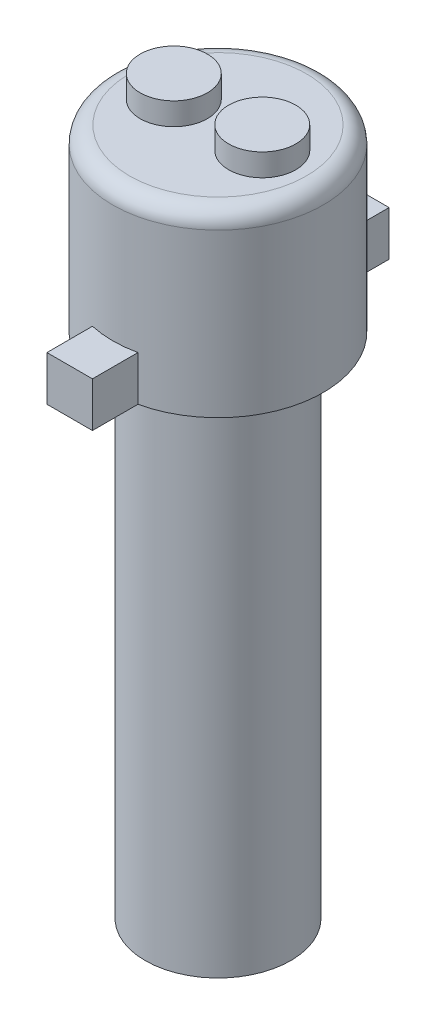
ISO-10303-21;
HEADER;
FILE_DESCRIPTION(('STEP AP214'),'2;1');
FILE_NAME('part.step','',(''),(''),'','','');
FILE_SCHEMA(('AUTOMOTIVE_DESIGN { 1 0 10303 214 1 1 1 1 }'));
ENDSEC;
DATA;
#1=APPLICATION_CONTEXT('core data for automotive mechanical design processes');
#2=APPLICATION_PROTOCOL_DEFINITION('international standard','automotive_design',2000,#1);
#3=PRODUCT_CONTEXT('',#1,'mechanical');
#4=PRODUCT('Part','Part','',(#3));
#5=PRODUCT_RELATED_PRODUCT_CATEGORY('part','',(#4));
#6=PRODUCT_DEFINITION_FORMATION('','',#4);
#7=PRODUCT_DEFINITION_CONTEXT('part definition',#1,'design');
#8=PRODUCT_DEFINITION('design','',#6,#7);
#9=PRODUCT_DEFINITION_SHAPE('','',#8);
#10=(LENGTH_UNIT() NAMED_UNIT(*) SI_UNIT(.MILLI.,.METRE.));
#11=(NAMED_UNIT(*) PLANE_ANGLE_UNIT() SI_UNIT($,.RADIAN.));
#12=(NAMED_UNIT(*) SI_UNIT($,.STERADIAN.) SOLID_ANGLE_UNIT());
#13=UNCERTAINTY_MEASURE_WITH_UNIT(LENGTH_MEASURE(1.E-05),#10,'distance_accuracy_value','');
#14=(GEOMETRIC_REPRESENTATION_CONTEXT(3) GLOBAL_UNCERTAINTY_ASSIGNED_CONTEXT((#13)) GLOBAL_UNIT_ASSIGNED_CONTEXT((#10,
#11,#12)) REPRESENTATION_CONTEXT('',''));
#15=CARTESIAN_POINT('',(0.,0.,0.));
#16=DIRECTION('',(0.,0.,1.));
#17=DIRECTION('',(1.,0.,0.));
#18=AXIS2_PLACEMENT_3D('',#15,#16,#17);
#19=CARTESIAN_POINT('',(0.,22.686,0.));
#20=DIRECTION('',(0.,-1.,0.));
#21=DIRECTION('',(0.,0.,-1.));
#22=AXIS2_PLACEMENT_3D('',#19,#20,#21);
#23=CYLINDRICAL_SURFACE('',#22,3.25);
#24=CARTESIAN_POINT('',(0.,22.686,0.));
#25=DIRECTION('',(0.,1.,0.));
#26=DIRECTION('',(0.,0.,1.));
#27=AXIS2_PLACEMENT_3D('',#24,#25,#26);
#28=CIRCLE('',#27,3.25);
#29=CARTESIAN_POINT('',(0.,22.686,3.25));
#30=VERTEX_POINT('',#29);
#31=EDGE_CURVE('E238',#30,#30,#28,.T.);
#32=ORIENTED_EDGE('',*,*,#31,.F.);
#33=EDGE_LOOP('',(#32));
#34=FACE_BOUND('',#33,.T.);
#35=CARTESIAN_POINT('',(0.,0.,0.));
#36=DIRECTION('',(0.,1.,0.));
#37=DIRECTION('',(0.,0.,1.));
#38=AXIS2_PLACEMENT_3D('',#35,#36,#37);
#39=CIRCLE('',#38,3.25);
#40=CARTESIAN_POINT('',(0.,0.,3.25));
#41=VERTEX_POINT('',#40);
#42=EDGE_CURVE('E237',#41,#41,#39,.T.);
#43=ORIENTED_EDGE('',*,*,#42,.T.);
#44=EDGE_LOOP('',(#43));
#45=FACE_BOUND('',#44,.T.);
#46=ADVANCED_FACE('F65',(#34,#45),#23,.T.);
#47=CARTESIAN_POINT('',(0.,0.,0.));
#48=DIRECTION('',(0.,1.,0.));
#49=DIRECTION('',(0.,0.,1.));
#50=AXIS2_PLACEMENT_3D('',#47,#48,#49);
#51=PLANE('',#50);
#52=ORIENTED_EDGE('',*,*,#42,.F.);
#53=EDGE_LOOP('',(#52));
#54=FACE_BOUND('',#53,.T.);
#55=ADVANCED_FACE('F267',(#54),#51,.F.);
#56=CARTESIAN_POINT('',(0.,30.686,0.));
#57=DIRECTION('',(0.,-1.,0.));
#58=DIRECTION('',(0.,0.,-1.));
#59=AXIS2_PLACEMENT_3D('',#56,#57,#58);
#60=CYLINDRICAL_SURFACE('',#59,4.7);
#61=CARTESIAN_POINT('',(0.,22.686,0.));
#62=DIRECTION('',(0.,1.,0.));
#63=DIRECTION('',(0.,0.,1.));
#64=AXIS2_PLACEMENT_3D('',#61,#62,#63);
#65=CIRCLE('',#64,4.7);
#66=CARTESIAN_POINT('',(-1.016,22.686,-4.58887175676113));
#67=VERTEX_POINT('',#66);
#68=CARTESIAN_POINT('',(-1.016,22.686,4.58887175676113));
#69=VERTEX_POINT('',#68);
#70=EDGE_CURVE('E230',#67,#69,#65,.T.);
#71=ORIENTED_EDGE('',*,*,#70,.T.);
#72=DIRECTION('',(0.,-1.,0.));
#73=VECTOR('',#72,1.);
#74=CARTESIAN_POINT('',(-1.016,24.686,4.58887175676113));
#75=LINE('',#74,#73);
#76=CARTESIAN_POINT('',(-1.016,24.686,4.58887175676113));
#77=VERTEX_POINT('',#76);
#78=EDGE_CURVE('E81',#77,#69,#75,.T.);
#79=ORIENTED_EDGE('',*,*,#78,.F.);
#80=CARTESIAN_POINT('',(0.,24.686,0.));
#81=DIRECTION('',(0.,1.,0.));
#82=DIRECTION('',(0.,0.,-1.));
#83=AXIS2_PLACEMENT_3D('',#80,#81,#82);
#84=CIRCLE('',#83,4.7);
#85=CARTESIAN_POINT('',(1.016,24.686,4.58887175676113));
#86=VERTEX_POINT('',#85);
#87=EDGE_CURVE('E85',#77,#86,#84,.T.);
#88=ORIENTED_EDGE('',*,*,#87,.T.);
#89=DIRECTION('',(0.,-1.,0.));
#90=VECTOR('',#89,1.);
#91=CARTESIAN_POINT('',(1.016,24.686,4.58887175676113));
#92=LINE('',#91,#90);
#93=CARTESIAN_POINT('',(1.016,22.686,4.58887175676113));
#94=VERTEX_POINT('',#93);
#95=EDGE_CURVE('E143',#86,#94,#92,.T.);
#96=ORIENTED_EDGE('',*,*,#95,.T.);
#97=CARTESIAN_POINT('',(1.016,22.686,-4.58887175676113));
#98=VERTEX_POINT('',#97);
#99=EDGE_CURVE('E234',#94,#98,#65,.T.);
#100=ORIENTED_EDGE('',*,*,#99,.T.);
#101=DIRECTION('',(0.,-1.,0.));
#102=VECTOR('',#101,1.);
#103=CARTESIAN_POINT('',(1.016,24.686,-4.58887175676113));
#104=LINE('',#103,#102);
#105=CARTESIAN_POINT('',(1.016,24.686,-4.58887175676113));
#106=VERTEX_POINT('',#105);
#107=EDGE_CURVE('E189',#106,#98,#104,.T.);
#108=ORIENTED_EDGE('',*,*,#107,.F.);
#109=CARTESIAN_POINT('',(0.,24.686,0.));
#110=DIRECTION('',(0.,1.,0.));
#111=DIRECTION('',(0.,0.,1.));
#112=AXIS2_PLACEMENT_3D('',#109,#110,#111);
#113=CIRCLE('',#112,4.7);
#114=CARTESIAN_POINT('',(-1.016,24.686,-4.58887175676113));
#115=VERTEX_POINT('',#114);
#116=EDGE_CURVE('E198',#106,#115,#113,.T.);
#117=ORIENTED_EDGE('',*,*,#116,.T.);
#118=DIRECTION('',(0.,-1.,0.));
#119=VECTOR('',#118,1.);
#120=CARTESIAN_POINT('',(-1.016,24.686,-4.58887175676113));
#121=LINE('',#120,#119);
#122=EDGE_CURVE('E178',#115,#67,#121,.T.);
#123=ORIENTED_EDGE('',*,*,#122,.T.);
#124=EDGE_LOOP('',(#71,#79,#88,#96,#100,#108,#117,#123));
#125=FACE_BOUND('',#124,.T.);
#126=CARTESIAN_POINT('',(0.,29.936,0.));
#127=DIRECTION('',(0.,1.,0.));
#128=DIRECTION('',(0.,0.,1.));
#129=AXIS2_PLACEMENT_3D('',#126,#127,#128);
#130=CIRCLE('',#129,4.7);
#131=CARTESIAN_POINT('',(0.,29.936,4.7));
#132=VERTEX_POINT('',#131);
#133=EDGE_CURVE('E12',#132,#132,#130,.F.);
#134=ORIENTED_EDGE('',*,*,#133,.T.);
#135=EDGE_LOOP('',(#134));
#136=FACE_BOUND('',#135,.T.);
#137=ADVANCED_FACE('F271',(#125,#136),#60,.T.);
#138=CARTESIAN_POINT('',(0.,30.686,0.));
#139=DIRECTION('',(0.,1.,0.));
#140=DIRECTION('',(0.,0.,1.));
#141=AXIS2_PLACEMENT_3D('',#138,#139,#140);
#142=PLANE('',#141);
#143=CARTESIAN_POINT('',(1.975,30.686,0.));
#144=DIRECTION('',(0.,1.,0.));
#145=DIRECTION('',(0.,0.,1.));
#146=AXIS2_PLACEMENT_3D('',#143,#144,#145);
#147=CIRCLE('',#146,1.5);
#148=CARTESIAN_POINT('',(1.975,30.686,1.5));
#149=VERTEX_POINT('',#148);
#150=EDGE_CURVE('E218',#149,#149,#147,.T.);
#151=ORIENTED_EDGE('',*,*,#150,.F.);
#152=EDGE_LOOP('',(#151));
#153=FACE_BOUND('',#152,.T.);
#154=CARTESIAN_POINT('',(-1.975,30.686,0.));
#155=DIRECTION('',(0.,1.,0.));
#156=DIRECTION('',(0.,0.,1.));
#157=AXIS2_PLACEMENT_3D('',#154,#155,#156);
#158=CIRCLE('',#157,1.5);
#159=CARTESIAN_POINT('',(-1.975,30.686,1.5));
#160=VERTEX_POINT('',#159);
#161=EDGE_CURVE('E222',#160,#160,#158,.T.);
#162=ORIENTED_EDGE('',*,*,#161,.F.);
#163=EDGE_LOOP('',(#162));
#164=FACE_BOUND('',#163,.T.);
#165=CARTESIAN_POINT('',(0.,30.686,0.));
#166=DIRECTION('',(0.,1.,0.));
#167=DIRECTION('',(0.,0.,1.));
#168=AXIS2_PLACEMENT_3D('',#165,#166,#167);
#169=CIRCLE('',#168,3.95);
#170=CARTESIAN_POINT('',(0.,30.686,3.95));
#171=VERTEX_POINT('',#170);
#172=EDGE_CURVE('E74',#171,#171,#169,.T.);
#173=ORIENTED_EDGE('',*,*,#172,.T.);
#174=EDGE_LOOP('',(#173));
#175=FACE_BOUND('',#174,.T.);
#176=ADVANCED_FACE('F248',(#153,#164,#175),#142,.T.);
#177=CARTESIAN_POINT('',(0.,22.686,0.));
#178=DIRECTION('',(0.,1.,0.));
#179=DIRECTION('',(0.,0.,1.));
#180=AXIS2_PLACEMENT_3D('',#177,#178,#179);
#181=PLANE('',#180);
#182=ORIENTED_EDGE('',*,*,#31,.T.);
#183=EDGE_LOOP('',(#182));
#184=FACE_BOUND('',#183,.T.);
#185=ORIENTED_EDGE('',*,*,#99,.F.);
#186=DIRECTION('',(0.,0.,1.));
#187=VECTOR('',#186,1.);
#188=CARTESIAN_POINT('',(1.016,22.686,6.62087175676113));
#189=LINE('',#188,#187);
#190=CARTESIAN_POINT('',(1.016,22.686,6.62087175676113));
#191=VERTEX_POINT('',#190);
#192=EDGE_CURVE('E162',#94,#191,#189,.T.);
#193=ORIENTED_EDGE('',*,*,#192,.T.);
#194=DIRECTION('',(-1.,0.,0.));
#195=VECTOR('',#194,1.);
#196=CARTESIAN_POINT('',(-1.016,22.686,6.62087175676113));
#197=LINE('',#196,#195);
#198=CARTESIAN_POINT('',(-1.016,22.686,6.62087175676113));
#199=VERTEX_POINT('',#198);
#200=EDGE_CURVE('E136',#191,#199,#197,.T.);
#201=ORIENTED_EDGE('',*,*,#200,.T.);
#202=DIRECTION('',(0.,0.,-1.));
#203=VECTOR('',#202,1.);
#204=CARTESIAN_POINT('',(-1.016,22.686,4.58887175676113));
#205=LINE('',#204,#203);
#206=EDGE_CURVE('E157',#199,#69,#205,.T.);
#207=ORIENTED_EDGE('',*,*,#206,.T.);
#208=ORIENTED_EDGE('',*,*,#70,.F.);
#209=DIRECTION('',(0.,0.,-1.));
#210=VECTOR('',#209,1.);
#211=CARTESIAN_POINT('',(-1.016,22.686,-4.58887175676113));
#212=LINE('',#211,#210);
#213=CARTESIAN_POINT('',(-1.016,22.686,-6.62087175676113));
#214=VERTEX_POINT('',#213);
#215=EDGE_CURVE('E165',#67,#214,#212,.T.);
#216=ORIENTED_EDGE('',*,*,#215,.T.);
#217=DIRECTION('',(1.,0.,0.));
#218=VECTOR('',#217,1.);
#219=CARTESIAN_POINT('',(-1.016,22.686,-6.62087175676113));
#220=LINE('',#219,#218);
#221=CARTESIAN_POINT('',(1.016,22.686,-6.62087175676113));
#222=VERTEX_POINT('',#221);
#223=EDGE_CURVE('E197',#214,#222,#220,.T.);
#224=ORIENTED_EDGE('',*,*,#223,.T.);
#225=DIRECTION('',(0.,0.,1.));
#226=VECTOR('',#225,1.);
#227=CARTESIAN_POINT('',(1.016,22.686,-6.62087175676113));
#228=LINE('',#227,#226);
#229=EDGE_CURVE('E193',#222,#98,#228,.T.);
#230=ORIENTED_EDGE('',*,*,#229,.T.);
#231=EDGE_LOOP('',(#185,#193,#201,#207,#208,#216,#224,#230));
#232=FACE_BOUND('',#231,.T.);
#233=ADVANCED_FACE('F252',(#184,#232),#181,.F.);
#234=CARTESIAN_POINT('',(0.,29.936,0.));
#235=DIRECTION('',(0.,1.,0.));
#236=DIRECTION('',(0.,0.,1.));
#237=AXIS2_PLACEMENT_3D('',#234,#235,#236);
#238=TOROIDAL_SURFACE('',#237,3.95,0.75);
#239=ORIENTED_EDGE('',*,*,#133,.F.);
#240=EDGE_LOOP('',(#239));
#241=FACE_BOUND('',#240,.T.);
#242=ORIENTED_EDGE('',*,*,#172,.F.);
#243=EDGE_LOOP('',(#242));
#244=FACE_BOUND('',#243,.T.);
#245=ADVANCED_FACE('F67',(#241,#244),#238,.T.);
#246=CARTESIAN_POINT('',(-1.975,31.686,0.));
#247=DIRECTION('',(0.,-1.,0.));
#248=DIRECTION('',(0.,0.,-1.));
#249=AXIS2_PLACEMENT_3D('',#246,#247,#248);
#250=CYLINDRICAL_SURFACE('',#249,1.5);
#251=CARTESIAN_POINT('',(-1.975,31.686,0.));
#252=DIRECTION('',(0.,1.,0.));
#253=DIRECTION('',(0.,0.,1.));
#254=AXIS2_PLACEMENT_3D('',#251,#252,#253);
#255=CIRCLE('',#254,1.5);
#256=CARTESIAN_POINT('',(-1.975,31.686,1.5));
#257=VERTEX_POINT('',#256);
#258=EDGE_CURVE('E226',#257,#257,#255,.T.);
#259=ORIENTED_EDGE('',*,*,#258,.F.);
#260=EDGE_LOOP('',(#259));
#261=FACE_BOUND('',#260,.T.);
#262=ORIENTED_EDGE('',*,*,#161,.T.);
#263=EDGE_LOOP('',(#262));
#264=FACE_BOUND('',#263,.T.);
#265=ADVANCED_FACE('F251',(#261,#264),#250,.T.);
#266=CARTESIAN_POINT('',(-1.975,31.686,0.));
#267=DIRECTION('',(0.,1.,0.));
#268=DIRECTION('',(0.,0.,1.));
#269=AXIS2_PLACEMENT_3D('',#266,#267,#268);
#270=PLANE('',#269);
#271=ORIENTED_EDGE('',*,*,#258,.T.);
#272=EDGE_LOOP('',(#271));
#273=FACE_BOUND('',#272,.T.);
#274=ADVANCED_FACE('F259',(#273),#270,.T.);
#275=CARTESIAN_POINT('',(1.975,31.686,0.));
#276=DIRECTION('',(0.,-1.,0.));
#277=DIRECTION('',(0.,0.,-1.));
#278=AXIS2_PLACEMENT_3D('',#275,#276,#277);
#279=CYLINDRICAL_SURFACE('',#278,1.5);
#280=CARTESIAN_POINT('',(1.975,31.686,0.));
#281=DIRECTION('',(0.,1.,0.));
#282=DIRECTION('',(0.,0.,1.));
#283=AXIS2_PLACEMENT_3D('',#280,#281,#282);
#284=CIRCLE('',#283,1.5);
#285=CARTESIAN_POINT('',(1.975,31.686,1.5));
#286=VERTEX_POINT('',#285);
#287=EDGE_CURVE('E173',#286,#286,#284,.T.);
#288=ORIENTED_EDGE('',*,*,#287,.F.);
#289=EDGE_LOOP('',(#288));
#290=FACE_BOUND('',#289,.T.);
#291=ORIENTED_EDGE('',*,*,#150,.T.);
#292=EDGE_LOOP('',(#291));
#293=FACE_BOUND('',#292,.T.);
#294=ADVANCED_FACE('F283',(#290,#293),#279,.T.);
#295=CARTESIAN_POINT('',(1.975,31.686,0.));
#296=DIRECTION('',(0.,1.,0.));
#297=DIRECTION('',(0.,0.,1.));
#298=AXIS2_PLACEMENT_3D('',#295,#296,#297);
#299=PLANE('',#298);
#300=ORIENTED_EDGE('',*,*,#287,.T.);
#301=EDGE_LOOP('',(#300));
#302=FACE_BOUND('',#301,.T.);
#303=ADVANCED_FACE('F285',(#302),#299,.T.);
#304=CARTESIAN_POINT('',(1.016,24.686,-6.62087175676113));
#305=DIRECTION('',(1.,0.,0.));
#306=DIRECTION('',(0.,0.,-1.));
#307=AXIS2_PLACEMENT_3D('',#304,#305,#306);
#308=PLANE('',#307);
#309=ORIENTED_EDGE('',*,*,#229,.F.);
#310=DIRECTION('',(0.,-1.,0.));
#311=VECTOR('',#310,1.);
#312=CARTESIAN_POINT('',(1.016,24.686,-6.62087175676113));
#313=LINE('',#312,#311);
#314=CARTESIAN_POINT('',(1.016,24.686,-6.62087175676113));
#315=VERTEX_POINT('',#314);
#316=EDGE_CURVE('E186',#315,#222,#313,.T.);
#317=ORIENTED_EDGE('',*,*,#316,.F.);
#318=DIRECTION('',(0.,0.,1.));
#319=VECTOR('',#318,1.);
#320=CARTESIAN_POINT('',(1.016,24.686,-6.62087175676113));
#321=LINE('',#320,#319);
#322=EDGE_CURVE('E182',#315,#106,#321,.T.);
#323=ORIENTED_EDGE('',*,*,#322,.T.);
#324=ORIENTED_EDGE('',*,*,#107,.T.);
#325=EDGE_LOOP('',(#309,#317,#323,#324));
#326=FACE_BOUND('',#325,.T.);
#327=ADVANCED_FACE('F288',(#326),#308,.T.);
#328=CARTESIAN_POINT('',(-1.016,24.686,-6.62087175676113));
#329=DIRECTION('',(0.,0.,-1.));
#330=DIRECTION('',(-1.,0.,0.));
#331=AXIS2_PLACEMENT_3D('',#328,#329,#330);
#332=PLANE('',#331);
#333=ORIENTED_EDGE('',*,*,#223,.F.);
#334=DIRECTION('',(0.,-1.,0.));
#335=VECTOR('',#334,1.);
#336=CARTESIAN_POINT('',(-1.016,24.686,-6.62087175676113));
#337=LINE('',#336,#335);
#338=CARTESIAN_POINT('',(-1.016,24.686,-6.62087175676113));
#339=VERTEX_POINT('',#338);
#340=EDGE_CURVE('E183',#339,#214,#337,.T.);
#341=ORIENTED_EDGE('',*,*,#340,.F.);
#342=DIRECTION('',(1.,0.,0.));
#343=VECTOR('',#342,1.);
#344=CARTESIAN_POINT('',(-1.016,24.686,-6.62087175676113));
#345=LINE('',#344,#343);
#346=EDGE_CURVE('E208',#339,#315,#345,.T.);
#347=ORIENTED_EDGE('',*,*,#346,.T.);
#348=ORIENTED_EDGE('',*,*,#316,.T.);
#349=EDGE_LOOP('',(#333,#341,#347,#348));
#350=FACE_BOUND('',#349,.T.);
#351=ADVANCED_FACE('F301',(#350),#332,.T.);
#352=CARTESIAN_POINT('',(-1.016,24.686,-4.58887175676113));
#353=DIRECTION('',(-1.,0.,0.));
#354=DIRECTION('',(0.,0.,1.));
#355=AXIS2_PLACEMENT_3D('',#352,#353,#354);
#356=PLANE('',#355);
#357=ORIENTED_EDGE('',*,*,#215,.F.);
#358=ORIENTED_EDGE('',*,*,#122,.F.);
#359=DIRECTION('',(0.,0.,-1.));
#360=VECTOR('',#359,1.);
#361=CARTESIAN_POINT('',(-1.016,24.686,-4.58887175676113));
#362=LINE('',#361,#360);
#363=EDGE_CURVE('E212',#115,#339,#362,.T.);
#364=ORIENTED_EDGE('',*,*,#363,.T.);
#365=ORIENTED_EDGE('',*,*,#340,.T.);
#366=EDGE_LOOP('',(#357,#358,#364,#365));
#367=FACE_BOUND('',#366,.T.);
#368=ADVANCED_FACE('F297',(#367),#356,.T.);
#369=CARTESIAN_POINT('',(0.,24.686,0.));
#370=DIRECTION('',(0.,1.,0.));
#371=DIRECTION('',(0.,0.,1.));
#372=AXIS2_PLACEMENT_3D('',#369,#370,#371);
#373=PLANE('',#372);
#374=ORIENTED_EDGE('',*,*,#116,.F.);
#375=ORIENTED_EDGE('',*,*,#322,.F.);
#376=ORIENTED_EDGE('',*,*,#346,.F.);
#377=ORIENTED_EDGE('',*,*,#363,.F.);
#378=EDGE_LOOP('',(#374,#375,#376,#377));
#379=FACE_BOUND('',#378,.T.);
#380=ADVANCED_FACE('F293',(#379),#373,.T.);
#381=CARTESIAN_POINT('',(-1.016,24.686,4.58887175676113));
#382=DIRECTION('',(-1.,0.,0.));
#383=DIRECTION('',(0.,0.,1.));
#384=AXIS2_PLACEMENT_3D('',#381,#382,#383);
#385=PLANE('',#384);
#386=ORIENTED_EDGE('',*,*,#206,.F.);
#387=DIRECTION('',(0.,-1.,0.));
#388=VECTOR('',#387,1.);
#389=CARTESIAN_POINT('',(-1.016,24.686,6.62087175676113));
#390=LINE('',#389,#388);
#391=CARTESIAN_POINT('',(-1.016,24.686,6.62087175676113));
#392=VERTEX_POINT('',#391);
#393=EDGE_CURVE('E142',#392,#199,#390,.T.);
#394=ORIENTED_EDGE('',*,*,#393,.F.);
#395=DIRECTION('',(0.,0.,-1.));
#396=VECTOR('',#395,1.);
#397=CARTESIAN_POINT('',(-1.016,24.686,4.58887175676113));
#398=LINE('',#397,#396);
#399=EDGE_CURVE('E150',#392,#77,#398,.T.);
#400=ORIENTED_EDGE('',*,*,#399,.T.);
#401=ORIENTED_EDGE('',*,*,#78,.T.);
#402=EDGE_LOOP('',(#386,#394,#400,#401));
#403=FACE_BOUND('',#402,.T.);
#404=ADVANCED_FACE('F296',(#403),#385,.T.);
#405=CARTESIAN_POINT('',(-1.016,24.686,6.62087175676113));
#406=DIRECTION('',(0.,0.,1.));
#407=DIRECTION('',(1.,0.,0.));
#408=AXIS2_PLACEMENT_3D('',#405,#406,#407);
#409=PLANE('',#408);
#410=ORIENTED_EDGE('',*,*,#200,.F.);
#411=DIRECTION('',(0.,-1.,0.));
#412=VECTOR('',#411,1.);
#413=CARTESIAN_POINT('',(1.016,24.686,6.62087175676113));
#414=LINE('',#413,#412);
#415=CARTESIAN_POINT('',(1.016,24.686,6.62087175676113));
#416=VERTEX_POINT('',#415);
#417=EDGE_CURVE('E130',#416,#191,#414,.T.);
#418=ORIENTED_EDGE('',*,*,#417,.F.);
#419=DIRECTION('',(-1.,0.,0.));
#420=VECTOR('',#419,1.);
#421=CARTESIAN_POINT('',(-1.016,24.686,6.62087175676113));
#422=LINE('',#421,#420);
#423=EDGE_CURVE('E133',#416,#392,#422,.T.);
#424=ORIENTED_EDGE('',*,*,#423,.T.);
#425=ORIENTED_EDGE('',*,*,#393,.T.);
#426=EDGE_LOOP('',(#410,#418,#424,#425));
#427=FACE_BOUND('',#426,.T.);
#428=ADVANCED_FACE('F132',(#427),#409,.T.);
#429=CARTESIAN_POINT('',(1.016,24.686,6.62087175676113));
#430=DIRECTION('',(1.,0.,0.));
#431=DIRECTION('',(0.,0.,-1.));
#432=AXIS2_PLACEMENT_3D('',#429,#430,#431);
#433=PLANE('',#432);
#434=ORIENTED_EDGE('',*,*,#192,.F.);
#435=ORIENTED_EDGE('',*,*,#95,.F.);
#436=DIRECTION('',(0.,0.,1.));
#437=VECTOR('',#436,1.);
#438=CARTESIAN_POINT('',(1.016,24.686,6.62087175676113));
#439=LINE('',#438,#437);
#440=EDGE_CURVE('E148',#86,#416,#439,.T.);
#441=ORIENTED_EDGE('',*,*,#440,.T.);
#442=ORIENTED_EDGE('',*,*,#417,.T.);
#443=EDGE_LOOP('',(#434,#435,#441,#442));
#444=FACE_BOUND('',#443,.T.);
#445=ADVANCED_FACE('F153',(#444),#433,.T.);
#446=CARTESIAN_POINT('',(0.,24.686,0.));
#447=DIRECTION('',(0.,-1.,0.));
#448=DIRECTION('',(0.,0.,-1.));
#449=AXIS2_PLACEMENT_3D('',#446,#447,#448);
#450=PLANE('',#449);
#451=ORIENTED_EDGE('',*,*,#87,.F.);
#452=ORIENTED_EDGE('',*,*,#399,.F.);
#453=ORIENTED_EDGE('',*,*,#423,.F.);
#454=ORIENTED_EDGE('',*,*,#440,.F.);
#455=EDGE_LOOP('',(#451,#452,#453,#454));
#456=FACE_BOUND('',#455,.T.);
#457=ADVANCED_FACE('F147',(#456),#450,.F.);
#458=CLOSED_SHELL('',(#46,#55,#137,#176,#233,#245,#265,#274,#294,#303,#327,#351,#368,#380,#404,
#428,#445,#457));
#459=MANIFOLD_SOLID_BREP('B2',#458);
#460=ADVANCED_BREP_SHAPE_REPRESENTATION('',(#18,#459),#14);
#461=SHAPE_DEFINITION_REPRESENTATION(#9,#460);
ENDSEC;
END-ISO-10303-21;
